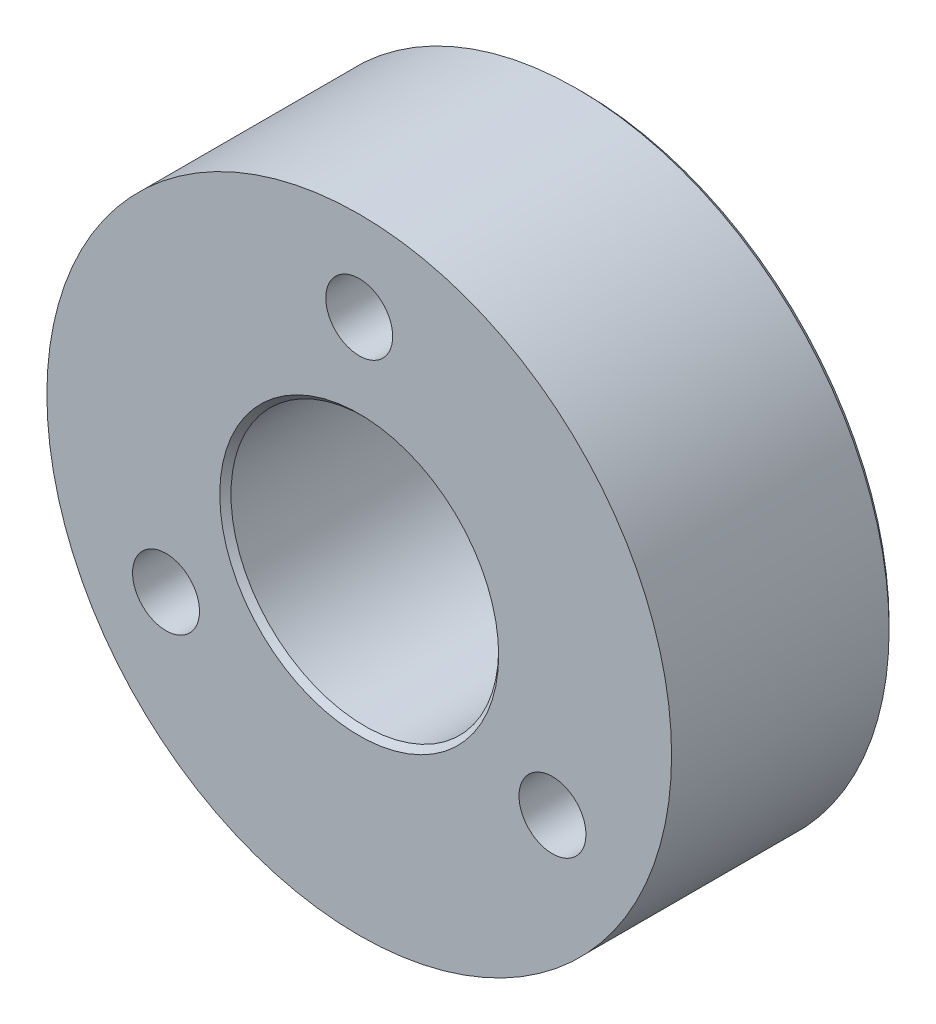
ISO-10303-21;
HEADER;
FILE_DESCRIPTION(('STEP AP214'),'2;1');
FILE_NAME('part.step','',(''),(''),'','','');
FILE_SCHEMA(('AUTOMOTIVE_DESIGN { 1 0 10303 214 1 1 1 1 }'));
ENDSEC;
DATA;
#1=APPLICATION_CONTEXT('core data for automotive mechanical design processes');
#2=APPLICATION_PROTOCOL_DEFINITION('international standard','automotive_design',2000,#1);
#3=PRODUCT_CONTEXT('',#1,'mechanical');
#4=PRODUCT('Part','Part','',(#3));
#5=PRODUCT_RELATED_PRODUCT_CATEGORY('part','',(#4));
#6=PRODUCT_DEFINITION_FORMATION('','',#4);
#7=PRODUCT_DEFINITION_CONTEXT('part definition',#1,'design');
#8=PRODUCT_DEFINITION('design','',#6,#7);
#9=PRODUCT_DEFINITION_SHAPE('','',#8);
#10=(LENGTH_UNIT() NAMED_UNIT(*) SI_UNIT(.MILLI.,.METRE.));
#11=(NAMED_UNIT(*) PLANE_ANGLE_UNIT() SI_UNIT($,.RADIAN.));
#12=(NAMED_UNIT(*) SI_UNIT($,.STERADIAN.) SOLID_ANGLE_UNIT());
#13=UNCERTAINTY_MEASURE_WITH_UNIT(LENGTH_MEASURE(1.E-05),#10,'distance_accuracy_value','');
#14=(GEOMETRIC_REPRESENTATION_CONTEXT(3) GLOBAL_UNCERTAINTY_ASSIGNED_CONTEXT((#13)) GLOBAL_UNIT_ASSIGNED_CONTEXT((#10,
#11,#12)) REPRESENTATION_CONTEXT('',''));
#15=CARTESIAN_POINT('',(0.,0.,0.));
#16=DIRECTION('',(0.,0.,1.));
#17=DIRECTION('',(1.,0.,0.));
#18=AXIS2_PLACEMENT_3D('',#15,#16,#17);
#19=CARTESIAN_POINT('',(0.,0.,10.));
#20=DIRECTION('',(0.,0.,1.));
#21=DIRECTION('',(1.,0.,0.));
#22=AXIS2_PLACEMENT_3D('',#19,#20,#21);
#23=PLANE('',#22);
#24=CARTESIAN_POINT('',(0.,0.,10.));
#25=DIRECTION('',(0.,0.,1.));
#26=DIRECTION('',(1.,0.,0.));
#27=AXIS2_PLACEMENT_3D('',#24,#25,#26);
#28=CIRCLE('',#27,6.25000000000002);
#29=CARTESIAN_POINT('',(6.25000000000002,0.,10.));
#30=VERTEX_POINT('',#29);
#31=EDGE_CURVE('E81',#30,#30,#28,.F.);
#32=ORIENTED_EDGE('',*,*,#31,.T.);
#33=EDGE_LOOP('',(#32));
#34=FACE_BOUND('',#33,.T.);
#35=CARTESIAN_POINT('',(8.66025403784503,-4.99999999999963,10.));
#36=DIRECTION('',(0.,0.,1.));
#37=DIRECTION('',(1.,0.,0.));
#38=AXIS2_PLACEMENT_3D('',#35,#36,#37);
#39=CIRCLE('',#38,1.50000000000055);
#40=CARTESIAN_POINT('',(10.1602540378456,-4.99999999999963,10.));
#41=VERTEX_POINT('',#40);
#42=EDGE_CURVE('E101',#41,#41,#39,.T.);
#43=ORIENTED_EDGE('',*,*,#42,.F.);
#44=EDGE_LOOP('',(#43));
#45=FACE_BOUND('',#44,.T.);
#46=CARTESIAN_POINT('',(0.,0.,10.));
#47=DIRECTION('',(0.,0.,1.));
#48=DIRECTION('',(1.,0.,0.));
#49=AXIS2_PLACEMENT_3D('',#46,#47,#48);
#50=CIRCLE('',#49,14.);
#51=CARTESIAN_POINT('',(14.,0.,10.));
#52=VERTEX_POINT('',#51);
#53=EDGE_CURVE('E93',#52,#52,#50,.T.);
#54=ORIENTED_EDGE('',*,*,#53,.T.);
#55=EDGE_LOOP('',(#54));
#56=FACE_BOUND('',#55,.T.);
#57=CARTESIAN_POINT('',(0.,10.,10.));
#58=DIRECTION('',(0.,0.,1.));
#59=DIRECTION('',(1.,0.,0.));
#60=AXIS2_PLACEMENT_3D('',#57,#58,#59);
#61=CIRCLE('',#60,1.5);
#62=CARTESIAN_POINT('',(1.5,10.,10.));
#63=VERTEX_POINT('',#62);
#64=EDGE_CURVE('E97',#63,#63,#61,.T.);
#65=ORIENTED_EDGE('',*,*,#64,.F.);
#66=EDGE_LOOP('',(#65));
#67=FACE_BOUND('',#66,.T.);
#68=CARTESIAN_POINT('',(-8.66025403784375,-5.00000000000037,10.));
#69=DIRECTION('',(0.,0.,1.));
#70=DIRECTION('',(1.,0.,0.));
#71=AXIS2_PLACEMENT_3D('',#68,#69,#70);
#72=CIRCLE('',#71,1.50000000000081);
#73=CARTESIAN_POINT('',(-7.16025403784294,-5.00000000000037,10.));
#74=VERTEX_POINT('',#73);
#75=EDGE_CURVE('E105',#74,#74,#72,.T.);
#76=ORIENTED_EDGE('',*,*,#75,.F.);
#77=EDGE_LOOP('',(#76));
#78=FACE_BOUND('',#77,.T.);
#79=ADVANCED_FACE('F37',(#34,#45,#56,#67,#78),#23,.T.);
#80=CARTESIAN_POINT('',(0.,0.,0.));
#81=DIRECTION('',(0.,0.,1.));
#82=DIRECTION('',(1.,0.,0.));
#83=AXIS2_PLACEMENT_3D('',#80,#81,#82);
#84=PLANE('',#83);
#85=CARTESIAN_POINT('',(-8.66025403784375,-5.00000000000037,0.));
#86=DIRECTION('',(0.,0.,1.));
#87=DIRECTION('',(1.,0.,0.));
#88=AXIS2_PLACEMENT_3D('',#85,#86,#87);
#89=CIRCLE('',#88,1.7500000000008);
#90=CARTESIAN_POINT('',(-6.91025403784294,-5.00000000000037,0.));
#91=VERTEX_POINT('',#90);
#92=EDGE_CURVE('E61',#91,#91,#89,.T.);
#93=ORIENTED_EDGE('',*,*,#92,.T.);
#94=EDGE_LOOP('',(#93));
#95=FACE_BOUND('',#94,.T.);
#96=CARTESIAN_POINT('',(8.66025403784503,-4.99999999999963,0.));
#97=DIRECTION('',(0.,0.,1.));
#98=DIRECTION('',(1.,0.,0.));
#99=AXIS2_PLACEMENT_3D('',#96,#97,#98);
#100=CIRCLE('',#99,1.75000000000055);
#101=CARTESIAN_POINT('',(10.4102540378456,-4.99999999999963,0.));
#102=VERTEX_POINT('',#101);
#103=EDGE_CURVE('E65',#102,#102,#100,.T.);
#104=ORIENTED_EDGE('',*,*,#103,.T.);
#105=EDGE_LOOP('',(#104));
#106=FACE_BOUND('',#105,.T.);
#107=CARTESIAN_POINT('',(0.,10.,0.));
#108=DIRECTION('',(0.,0.,1.));
#109=DIRECTION('',(1.,0.,0.));
#110=AXIS2_PLACEMENT_3D('',#107,#108,#109);
#111=CIRCLE('',#110,1.74999999999999);
#112=CARTESIAN_POINT('',(1.74999999999999,10.,0.));
#113=VERTEX_POINT('',#112);
#114=EDGE_CURVE('E69',#113,#113,#111,.T.);
#115=ORIENTED_EDGE('',*,*,#114,.T.);
#116=EDGE_LOOP('',(#115));
#117=FACE_BOUND('',#116,.T.);
#118=CARTESIAN_POINT('',(0.,0.,0.));
#119=DIRECTION('',(0.,0.,1.));
#120=DIRECTION('',(1.,0.,0.));
#121=AXIS2_PLACEMENT_3D('',#118,#119,#120);
#122=CIRCLE('',#121,6.25);
#123=CARTESIAN_POINT('',(6.25,0.,0.));
#124=VERTEX_POINT('',#123);
#125=EDGE_CURVE('E73',#124,#124,#122,.T.);
#126=ORIENTED_EDGE('',*,*,#125,.T.);
#127=EDGE_LOOP('',(#126));
#128=FACE_BOUND('',#127,.T.);
#129=CARTESIAN_POINT('',(0.,0.,0.));
#130=DIRECTION('',(0.,0.,1.));
#131=DIRECTION('',(1.,0.,0.));
#132=AXIS2_PLACEMENT_3D('',#129,#130,#131);
#133=CIRCLE('',#132,13.75);
#134=CARTESIAN_POINT('',(13.75,0.,0.));
#135=VERTEX_POINT('',#134);
#136=EDGE_CURVE('E77',#135,#135,#133,.F.);
#137=ORIENTED_EDGE('',*,*,#136,.T.);
#138=EDGE_LOOP('',(#137));
#139=FACE_BOUND('',#138,.T.);
#140=ADVANCED_FACE('F113',(#95,#106,#117,#128,#139),#84,.F.);
#141=CARTESIAN_POINT('',(0.,0.,10.));
#142=DIRECTION('',(0.,0.,-1.));
#143=DIRECTION('',(-1.,0.,0.));
#144=AXIS2_PLACEMENT_3D('',#141,#142,#143);
#145=CYLINDRICAL_SURFACE('',#144,14.);
#146=CARTESIAN_POINT('',(0.,0.,0.25));
#147=DIRECTION('',(0.,0.,1.));
#148=DIRECTION('',(1.,0.,0.));
#149=AXIS2_PLACEMENT_3D('',#146,#147,#148);
#150=CIRCLE('',#149,14.);
#151=CARTESIAN_POINT('',(14.,0.,0.25));
#152=VERTEX_POINT('',#151);
#153=EDGE_CURVE('E10',#152,#152,#150,.T.);
#154=ORIENTED_EDGE('',*,*,#153,.T.);
#155=EDGE_LOOP('',(#154));
#156=FACE_BOUND('',#155,.T.);
#157=ORIENTED_EDGE('',*,*,#53,.F.);
#158=EDGE_LOOP('',(#157));
#159=FACE_BOUND('',#158,.T.);
#160=ADVANCED_FACE('F119',(#156,#159),#145,.T.);
#161=CARTESIAN_POINT('',(0.,0.,10.));
#162=DIRECTION('',(0.,0.,-1.));
#163=DIRECTION('',(-1.,0.,0.));
#164=AXIS2_PLACEMENT_3D('',#161,#162,#163);
#165=CYLINDRICAL_SURFACE('',#164,6.);
#166=CARTESIAN_POINT('',(0.,0.,9.74999999999999));
#167=DIRECTION('',(0.,0.,1.));
#168=DIRECTION('',(1.,0.,0.));
#169=AXIS2_PLACEMENT_3D('',#166,#167,#168);
#170=CIRCLE('',#169,6.);
#171=CARTESIAN_POINT('',(6.,0.,9.74999999999999));
#172=VERTEX_POINT('',#171);
#173=EDGE_CURVE('E85',#172,#172,#170,.T.);
#174=ORIENTED_EDGE('',*,*,#173,.T.);
#175=EDGE_LOOP('',(#174));
#176=FACE_BOUND('',#175,.T.);
#177=CARTESIAN_POINT('',(0.,0.,0.25));
#178=DIRECTION('',(0.,0.,1.));
#179=DIRECTION('',(1.,0.,0.));
#180=AXIS2_PLACEMENT_3D('',#177,#178,#179);
#181=CIRCLE('',#180,6.);
#182=CARTESIAN_POINT('',(6.,0.,0.25));
#183=VERTEX_POINT('',#182);
#184=EDGE_CURVE('E89',#183,#183,#181,.F.);
#185=ORIENTED_EDGE('',*,*,#184,.T.);
#186=EDGE_LOOP('',(#185));
#187=FACE_BOUND('',#186,.T.);
#188=ADVANCED_FACE('F124',(#176,#187),#165,.F.);
#189=CARTESIAN_POINT('',(0.,10.,10.));
#190=DIRECTION('',(0.,0.,-1.));
#191=DIRECTION('',(-1.,0.,0.));
#192=AXIS2_PLACEMENT_3D('',#189,#190,#191);
#193=CYLINDRICAL_SURFACE('',#192,1.5);
#194=CARTESIAN_POINT('',(0.,10.,0.249999999999997));
#195=DIRECTION('',(0.,0.,1.));
#196=DIRECTION('',(1.,0.,0.));
#197=AXIS2_PLACEMENT_3D('',#194,#195,#196);
#198=CIRCLE('',#197,1.5);
#199=CARTESIAN_POINT('',(1.5,10.,0.249999999999997));
#200=VERTEX_POINT('',#199);
#201=EDGE_CURVE('E45',#200,#200,#198,.F.);
#202=ORIENTED_EDGE('',*,*,#201,.T.);
#203=EDGE_LOOP('',(#202));
#204=FACE_BOUND('',#203,.T.);
#205=ORIENTED_EDGE('',*,*,#64,.T.);
#206=EDGE_LOOP('',(#205));
#207=FACE_BOUND('',#206,.T.);
#208=ADVANCED_FACE('F160',(#204,#207),#193,.F.);
#209=CARTESIAN_POINT('',(8.66025403784503,-4.99999999999963,10.));
#210=DIRECTION('',(0.,0.,-1.));
#211=DIRECTION('',(-1.,0.,0.));
#212=AXIS2_PLACEMENT_3D('',#209,#210,#211);
#213=CYLINDRICAL_SURFACE('',#212,1.50000000000055);
#214=CARTESIAN_POINT('',(8.66025403784503,-4.99999999999963,0.249999999999997));
#215=DIRECTION('',(0.,0.,1.));
#216=DIRECTION('',(1.,0.,0.));
#217=AXIS2_PLACEMENT_3D('',#214,#215,#216);
#218=CIRCLE('',#217,1.50000000000055);
#219=CARTESIAN_POINT('',(10.1602540378456,-4.99999999999963,0.249999999999997));
#220=VERTEX_POINT('',#219);
#221=EDGE_CURVE('E50',#220,#220,#218,.F.);
#222=ORIENTED_EDGE('',*,*,#221,.T.);
#223=EDGE_LOOP('',(#222));
#224=FACE_BOUND('',#223,.T.);
#225=ORIENTED_EDGE('',*,*,#42,.T.);
#226=EDGE_LOOP('',(#225));
#227=FACE_BOUND('',#226,.T.);
#228=ADVANCED_FACE('F165',(#224,#227),#213,.F.);
#229=CARTESIAN_POINT('',(-8.66025403784375,-5.00000000000037,10.));
#230=DIRECTION('',(0.,0.,-1.));
#231=DIRECTION('',(-1.,0.,0.));
#232=AXIS2_PLACEMENT_3D('',#229,#230,#231);
#233=CYLINDRICAL_SURFACE('',#232,1.50000000000081);
#234=CARTESIAN_POINT('',(-8.66025403784375,-5.00000000000037,0.250000000000002));
#235=DIRECTION('',(0.,0.,1.));
#236=DIRECTION('',(1.,0.,0.));
#237=AXIS2_PLACEMENT_3D('',#234,#235,#236);
#238=CIRCLE('',#237,1.50000000000081);
#239=CARTESIAN_POINT('',(-7.16025403784294,-5.00000000000037,0.250000000000002));
#240=VERTEX_POINT('',#239);
#241=EDGE_CURVE('E55',#240,#240,#238,.F.);
#242=ORIENTED_EDGE('',*,*,#241,.T.);
#243=EDGE_LOOP('',(#242));
#244=FACE_BOUND('',#243,.T.);
#245=ORIENTED_EDGE('',*,*,#75,.T.);
#246=EDGE_LOOP('',(#245));
#247=FACE_BOUND('',#246,.T.);
#248=ADVANCED_FACE('F110',(#244,#247),#233,.F.);
#249=CARTESIAN_POINT('',(0.,0.,9.74999999999999));
#250=DIRECTION('',(0.,0.,1.));
#251=DIRECTION('',(1.,0.,0.));
#252=AXIS2_PLACEMENT_3D('',#249,#250,#251);
#253=CONICAL_SURFACE('',#252,6.,0.785398163397455);
#254=ORIENTED_EDGE('',*,*,#31,.F.);
#255=EDGE_LOOP('',(#254));
#256=FACE_BOUND('',#255,.T.);
#257=ORIENTED_EDGE('',*,*,#173,.F.);
#258=EDGE_LOOP('',(#257));
#259=FACE_BOUND('',#258,.T.);
#260=ADVANCED_FACE('F129',(#256,#259),#253,.F.);
#261=CARTESIAN_POINT('',(-8.66025403784375,-5.00000000000037,0.));
#262=DIRECTION('',(0.,0.,-1.));
#263=DIRECTION('',(-1.,0.,0.));
#264=AXIS2_PLACEMENT_3D('',#261,#262,#263);
#265=CONICAL_SURFACE('',#264,1.7500000000008,0.785398163397438);
#266=ORIENTED_EDGE('',*,*,#241,.F.);
#267=EDGE_LOOP('',(#266));
#268=FACE_BOUND('',#267,.T.);
#269=ORIENTED_EDGE('',*,*,#92,.F.);
#270=EDGE_LOOP('',(#269));
#271=FACE_BOUND('',#270,.T.);
#272=ADVANCED_FACE('F132',(#268,#271),#265,.F.);
#273=CARTESIAN_POINT('',(8.66025403784503,-4.99999999999963,0.));
#274=DIRECTION('',(0.,0.,-1.));
#275=DIRECTION('',(-1.,0.,0.));
#276=AXIS2_PLACEMENT_3D('',#273,#274,#275);
#277=CONICAL_SURFACE('',#276,1.75000000000055,0.785398163397452);
#278=ORIENTED_EDGE('',*,*,#221,.F.);
#279=EDGE_LOOP('',(#278));
#280=FACE_BOUND('',#279,.T.);
#281=ORIENTED_EDGE('',*,*,#103,.F.);
#282=EDGE_LOOP('',(#281));
#283=FACE_BOUND('',#282,.T.);
#284=ADVANCED_FACE('F136',(#280,#283),#277,.F.);
#285=CARTESIAN_POINT('',(0.,10.,0.));
#286=DIRECTION('',(0.,0.,-1.));
#287=DIRECTION('',(-1.,0.,0.));
#288=AXIS2_PLACEMENT_3D('',#285,#286,#287);
#289=CONICAL_SURFACE('',#288,1.74999999999999,0.785398163397444);
#290=ORIENTED_EDGE('',*,*,#201,.F.);
#291=EDGE_LOOP('',(#290));
#292=FACE_BOUND('',#291,.T.);
#293=ORIENTED_EDGE('',*,*,#114,.F.);
#294=EDGE_LOOP('',(#293));
#295=FACE_BOUND('',#294,.T.);
#296=ADVANCED_FACE('F140',(#292,#295),#289,.F.);
#297=CARTESIAN_POINT('',(0.,0.,0.));
#298=DIRECTION('',(0.,0.,-1.));
#299=DIRECTION('',(-1.,0.,0.));
#300=AXIS2_PLACEMENT_3D('',#297,#298,#299);
#301=CONICAL_SURFACE('',#300,6.25,0.78539816339745);
#302=ORIENTED_EDGE('',*,*,#184,.F.);
#303=EDGE_LOOP('',(#302));
#304=FACE_BOUND('',#303,.T.);
#305=ORIENTED_EDGE('',*,*,#125,.F.);
#306=EDGE_LOOP('',(#305));
#307=FACE_BOUND('',#306,.T.);
#308=ADVANCED_FACE('F143',(#304,#307),#301,.F.);
#309=CARTESIAN_POINT('',(0.,0.,0.25));
#310=DIRECTION('',(0.,0.,1.));
#311=DIRECTION('',(1.,0.,0.));
#312=AXIS2_PLACEMENT_3D('',#309,#310,#311);
#313=CONICAL_SURFACE('',#312,14.,0.785398163397448);
#314=ORIENTED_EDGE('',*,*,#136,.F.);
#315=EDGE_LOOP('',(#314));
#316=FACE_BOUND('',#315,.T.);
#317=ORIENTED_EDGE('',*,*,#153,.F.);
#318=EDGE_LOOP('',(#317));
#319=FACE_BOUND('',#318,.T.);
#320=ADVANCED_FACE('F39',(#316,#319),#313,.T.);
#321=CLOSED_SHELL('',(#79,#140,#160,#188,#208,#228,#248,#260,#272,#284,#296,#308,#320));
#322=MANIFOLD_SOLID_BREP('B2',#321);
#323=ADVANCED_BREP_SHAPE_REPRESENTATION('',(#18,#322),#14);
#324=SHAPE_DEFINITION_REPRESENTATION(#9,#323);
ENDSEC;
END-ISO-10303-21;
